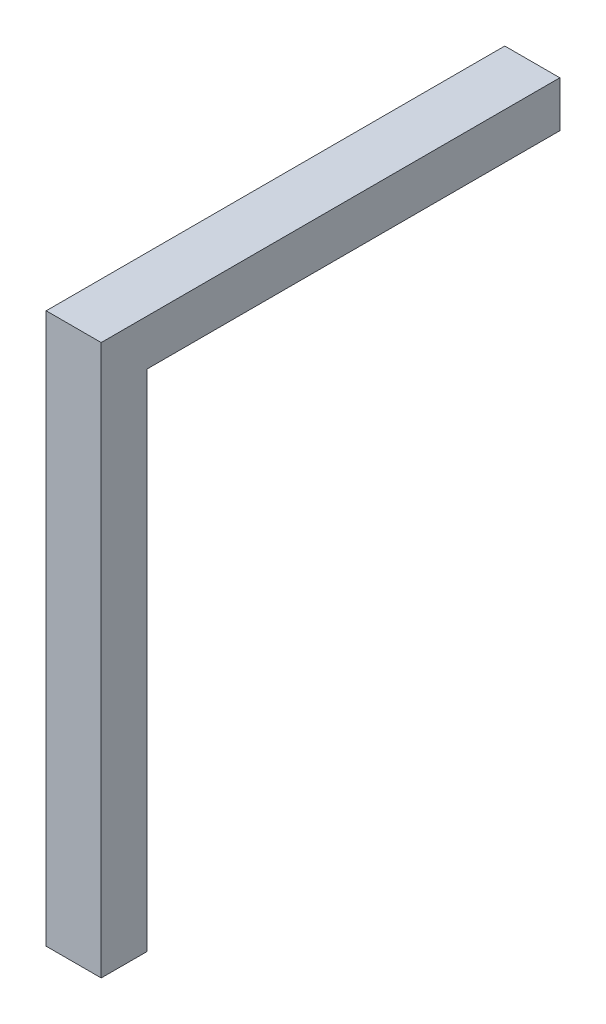
ISO-10303-21;
HEADER;
FILE_DESCRIPTION(('STEP AP214'),'2;1');
FILE_NAME('part.step','',(''),(''),'','','');
FILE_SCHEMA(('AUTOMOTIVE_DESIGN { 1 0 10303 214 1 1 1 1 }'));
ENDSEC;
DATA;
#1=APPLICATION_CONTEXT('core data for automotive mechanical design processes');
#2=APPLICATION_PROTOCOL_DEFINITION('international standard','automotive_design',2000,#1);
#3=PRODUCT_CONTEXT('',#1,'mechanical');
#4=PRODUCT('Part','Part','',(#3));
#5=PRODUCT_RELATED_PRODUCT_CATEGORY('part','',(#4));
#6=PRODUCT_DEFINITION_FORMATION('','',#4);
#7=PRODUCT_DEFINITION_CONTEXT('part definition',#1,'design');
#8=PRODUCT_DEFINITION('design','',#6,#7);
#9=PRODUCT_DEFINITION_SHAPE('','',#8);
#10=(LENGTH_UNIT() NAMED_UNIT(*) SI_UNIT(.MILLI.,.METRE.));
#11=(NAMED_UNIT(*) PLANE_ANGLE_UNIT() SI_UNIT($,.RADIAN.));
#12=(NAMED_UNIT(*) SI_UNIT($,.STERADIAN.) SOLID_ANGLE_UNIT());
#13=UNCERTAINTY_MEASURE_WITH_UNIT(LENGTH_MEASURE(1.E-05),#10,'distance_accuracy_value','');
#14=(GEOMETRIC_REPRESENTATION_CONTEXT(3) GLOBAL_UNCERTAINTY_ASSIGNED_CONTEXT((#13)) GLOBAL_UNIT_ASSIGNED_CONTEXT((#10,
#11,#12)) REPRESENTATION_CONTEXT('',''));
#15=CARTESIAN_POINT('',(0.,0.,0.));
#16=DIRECTION('',(0.,0.,1.));
#17=DIRECTION('',(1.,0.,0.));
#18=AXIS2_PLACEMENT_3D('',#15,#16,#17);
#19=CARTESIAN_POINT('',(6.,31.4321608040201,10.));
#20=DIRECTION('',(0.,0.,1.));
#21=DIRECTION('',(1.,0.,0.));
#22=AXIS2_PLACEMENT_3D('',#19,#20,#21);
#23=PLANE('',#22);
#24=DIRECTION('',(0.,1.,0.));
#25=VECTOR('',#24,1.);
#26=CARTESIAN_POINT('',(0.,31.4321608040201,10.));
#27=LINE('',#26,#25);
#28=CARTESIAN_POINT('',(0.,31.4321608040201,10.));
#29=VERTEX_POINT('',#28);
#30=CARTESIAN_POINT('',(0.,36.4321608040201,10.));
#31=VERTEX_POINT('',#30);
#32=EDGE_CURVE('E128',#29,#31,#27,.T.);
#33=ORIENTED_EDGE('',*,*,#32,.T.);
#34=DIRECTION('',(-1.,0.,0.));
#35=VECTOR('',#34,1.);
#36=CARTESIAN_POINT('',(6.,36.4321608040201,10.));
#37=LINE('',#36,#35);
#38=CARTESIAN_POINT('',(6.,36.4321608040201,10.));
#39=VERTEX_POINT('',#38);
#40=EDGE_CURVE('E11',#39,#31,#37,.T.);
#41=ORIENTED_EDGE('',*,*,#40,.F.);
#42=DIRECTION('',(0.,1.,0.));
#43=VECTOR('',#42,1.);
#44=CARTESIAN_POINT('',(6.,31.4321608040201,10.));
#45=LINE('',#44,#43);
#46=CARTESIAN_POINT('',(6.,31.4321608040201,10.));
#47=VERTEX_POINT('',#46);
#48=EDGE_CURVE('E144',#47,#39,#45,.T.);
#49=ORIENTED_EDGE('',*,*,#48,.F.);
#50=DIRECTION('',(-1.,0.,0.));
#51=VECTOR('',#50,1.);
#52=CARTESIAN_POINT('',(6.,31.4321608040201,10.));
#53=LINE('',#52,#51);
#54=EDGE_CURVE('E124',#47,#29,#53,.T.);
#55=ORIENTED_EDGE('',*,*,#54,.T.);
#56=EDGE_LOOP('',(#33,#41,#49,#55));
#57=FACE_BOUND('',#56,.T.);
#58=ADVANCED_FACE('F39',(#57),#23,.F.);
#59=CARTESIAN_POINT('',(6.,36.4321608040201,10.));
#60=DIRECTION('',(0.,-1.,0.));
#61=DIRECTION('',(0.,0.,-1.));
#62=AXIS2_PLACEMENT_3D('',#59,#60,#61);
#63=PLANE('',#62);
#64=DIRECTION('',(0.,0.,1.));
#65=VECTOR('',#64,1.);
#66=CARTESIAN_POINT('',(0.,36.4321608040201,10.));
#67=LINE('',#66,#65);
#68=CARTESIAN_POINT('',(0.,36.4321608040201,60.));
#69=VERTEX_POINT('',#68);
#70=EDGE_CURVE('E132',#31,#69,#67,.T.);
#71=ORIENTED_EDGE('',*,*,#70,.T.);
#72=DIRECTION('',(-1.,0.,0.));
#73=VECTOR('',#72,1.);
#74=CARTESIAN_POINT('',(6.,36.4321608040201,60.));
#75=LINE('',#74,#73);
#76=CARTESIAN_POINT('',(6.,36.4321608040201,60.));
#77=VERTEX_POINT('',#76);
#78=EDGE_CURVE('E48',#77,#69,#75,.T.);
#79=ORIENTED_EDGE('',*,*,#78,.F.);
#80=DIRECTION('',(0.,0.,1.));
#81=VECTOR('',#80,1.);
#82=CARTESIAN_POINT('',(6.,36.4321608040201,10.));
#83=LINE('',#82,#81);
#84=EDGE_CURVE('E93',#39,#77,#83,.T.);
#85=ORIENTED_EDGE('',*,*,#84,.F.);
#86=ORIENTED_EDGE('',*,*,#40,.T.);
#87=EDGE_LOOP('',(#71,#79,#85,#86));
#88=FACE_BOUND('',#87,.T.);
#89=ADVANCED_FACE('F172',(#88),#63,.F.);
#90=CARTESIAN_POINT('',(6.,36.4321608040201,60.));
#91=DIRECTION('',(0.,0.,-1.));
#92=DIRECTION('',(0.,1.,0.));
#93=AXIS2_PLACEMENT_3D('',#90,#91,#92);
#94=PLANE('',#93);
#95=DIRECTION('',(0.,-1.,0.));
#96=VECTOR('',#95,1.);
#97=CARTESIAN_POINT('',(0.,36.4321608040201,60.));
#98=LINE('',#97,#96);
#99=CARTESIAN_POINT('',(0.,-23.5678391959799,60.));
#100=VERTEX_POINT('',#99);
#101=EDGE_CURVE('E135',#69,#100,#98,.T.);
#102=ORIENTED_EDGE('',*,*,#101,.T.);
#103=DIRECTION('',(-1.,0.,0.));
#104=VECTOR('',#103,1.);
#105=CARTESIAN_POINT('',(6.,-23.5678391959799,60.));
#106=LINE('',#105,#104);
#107=CARTESIAN_POINT('',(6.,-23.5678391959799,60.));
#108=VERTEX_POINT('',#107);
#109=EDGE_CURVE('E117',#108,#100,#106,.T.);
#110=ORIENTED_EDGE('',*,*,#109,.F.);
#111=DIRECTION('',(0.,-1.,0.));
#112=VECTOR('',#111,1.);
#113=CARTESIAN_POINT('',(6.,36.4321608040201,60.));
#114=LINE('',#113,#112);
#115=EDGE_CURVE('E106',#77,#108,#114,.T.);
#116=ORIENTED_EDGE('',*,*,#115,.F.);
#117=ORIENTED_EDGE('',*,*,#78,.T.);
#118=EDGE_LOOP('',(#102,#110,#116,#117));
#119=FACE_BOUND('',#118,.T.);
#120=ADVANCED_FACE('F154',(#119),#94,.F.);
#121=CARTESIAN_POINT('',(6.,-23.5678391959799,60.));
#122=DIRECTION('',(0.,1.,0.));
#123=DIRECTION('',(0.,0.,1.));
#124=AXIS2_PLACEMENT_3D('',#121,#122,#123);
#125=PLANE('',#124);
#126=DIRECTION('',(0.,0.,-1.));
#127=VECTOR('',#126,1.);
#128=CARTESIAN_POINT('',(0.,-23.5678391959799,60.));
#129=LINE('',#128,#127);
#130=CARTESIAN_POINT('',(0.,-23.5678391959799,55.));
#131=VERTEX_POINT('',#130);
#132=EDGE_CURVE('E115',#100,#131,#129,.T.);
#133=ORIENTED_EDGE('',*,*,#132,.T.);
#134=DIRECTION('',(-1.,0.,0.));
#135=VECTOR('',#134,1.);
#136=CARTESIAN_POINT('',(6.,-23.5678391959799,55.));
#137=LINE('',#136,#135);
#138=CARTESIAN_POINT('',(6.,-23.5678391959799,55.));
#139=VERTEX_POINT('',#138);
#140=EDGE_CURVE('E112',#139,#131,#137,.T.);
#141=ORIENTED_EDGE('',*,*,#140,.F.);
#142=DIRECTION('',(0.,0.,-1.));
#143=VECTOR('',#142,1.);
#144=CARTESIAN_POINT('',(6.,-23.5678391959799,60.));
#145=LINE('',#144,#143);
#146=EDGE_CURVE('E100',#108,#139,#145,.T.);
#147=ORIENTED_EDGE('',*,*,#146,.F.);
#148=ORIENTED_EDGE('',*,*,#109,.T.);
#149=EDGE_LOOP('',(#133,#141,#147,#148));
#150=FACE_BOUND('',#149,.T.);
#151=ADVANCED_FACE('F113',(#150),#125,.F.);
#152=CARTESIAN_POINT('',(6.,-23.5678391959799,55.));
#153=DIRECTION('',(0.,0.,1.));
#154=DIRECTION('',(1.,0.,0.));
#155=AXIS2_PLACEMENT_3D('',#152,#153,#154);
#156=PLANE('',#155);
#157=DIRECTION('',(0.,1.,0.));
#158=VECTOR('',#157,1.);
#159=CARTESIAN_POINT('',(0.,-23.5678391959799,55.));
#160=LINE('',#159,#158);
#161=CARTESIAN_POINT('',(0.,31.4321608040201,55.));
#162=VERTEX_POINT('',#161);
#163=EDGE_CURVE('E79',#131,#162,#160,.T.);
#164=ORIENTED_EDGE('',*,*,#163,.T.);
#165=DIRECTION('',(-1.,0.,0.));
#166=VECTOR('',#165,1.);
#167=CARTESIAN_POINT('',(6.,31.4321608040201,55.));
#168=LINE('',#167,#166);
#169=CARTESIAN_POINT('',(6.,31.4321608040201,55.));
#170=VERTEX_POINT('',#169);
#171=EDGE_CURVE('E118',#170,#162,#168,.T.);
#172=ORIENTED_EDGE('',*,*,#171,.F.);
#173=DIRECTION('',(0.,1.,0.));
#174=VECTOR('',#173,1.);
#175=CARTESIAN_POINT('',(6.,-23.5678391959799,55.));
#176=LINE('',#175,#174);
#177=EDGE_CURVE('E104',#139,#170,#176,.T.);
#178=ORIENTED_EDGE('',*,*,#177,.F.);
#179=ORIENTED_EDGE('',*,*,#140,.T.);
#180=EDGE_LOOP('',(#164,#172,#178,#179));
#181=FACE_BOUND('',#180,.T.);
#182=ADVANCED_FACE('F120',(#181),#156,.F.);
#183=CARTESIAN_POINT('',(6.,31.4321608040201,55.));
#184=DIRECTION('',(0.,1.,0.));
#185=DIRECTION('',(0.,0.,1.));
#186=AXIS2_PLACEMENT_3D('',#183,#184,#185);
#187=PLANE('',#186);
#188=DIRECTION('',(0.,0.,-1.));
#189=VECTOR('',#188,1.);
#190=CARTESIAN_POINT('',(0.,31.4321608040201,55.));
#191=LINE('',#190,#189);
#192=EDGE_CURVE('E85',#162,#29,#191,.T.);
#193=ORIENTED_EDGE('',*,*,#192,.T.);
#194=ORIENTED_EDGE('',*,*,#54,.F.);
#195=DIRECTION('',(0.,0.,-1.));
#196=VECTOR('',#195,1.);
#197=CARTESIAN_POINT('',(6.,31.4321608040201,55.));
#198=LINE('',#197,#196);
#199=EDGE_CURVE('E56',#170,#47,#198,.T.);
#200=ORIENTED_EDGE('',*,*,#199,.F.);
#201=ORIENTED_EDGE('',*,*,#171,.T.);
#202=EDGE_LOOP('',(#193,#194,#200,#201));
#203=FACE_BOUND('',#202,.T.);
#204=ADVANCED_FACE('F161',(#203),#187,.F.);
#205=CARTESIAN_POINT('',(6.,0.,0.));
#206=DIRECTION('',(1.,0.,0.));
#207=DIRECTION('',(0.,0.,-1.));
#208=AXIS2_PLACEMENT_3D('',#205,#206,#207);
#209=PLANE('',#208);
#210=ORIENTED_EDGE('',*,*,#48,.T.);
#211=ORIENTED_EDGE('',*,*,#84,.T.);
#212=ORIENTED_EDGE('',*,*,#115,.T.);
#213=ORIENTED_EDGE('',*,*,#146,.T.);
#214=ORIENTED_EDGE('',*,*,#177,.T.);
#215=ORIENTED_EDGE('',*,*,#199,.T.);
#216=EDGE_LOOP('',(#210,#211,#212,#213,#214,#215));
#217=FACE_BOUND('',#216,.T.);
#218=ADVANCED_FACE('F102',(#217),#209,.T.);
#219=CARTESIAN_POINT('',(0.,0.,0.));
#220=DIRECTION('',(1.,0.,0.));
#221=DIRECTION('',(0.,0.,-1.));
#222=AXIS2_PLACEMENT_3D('',#219,#220,#221);
#223=PLANE('',#222);
#224=ORIENTED_EDGE('',*,*,#32,.F.);
#225=ORIENTED_EDGE('',*,*,#192,.F.);
#226=ORIENTED_EDGE('',*,*,#163,.F.);
#227=ORIENTED_EDGE('',*,*,#132,.F.);
#228=ORIENTED_EDGE('',*,*,#101,.F.);
#229=ORIENTED_EDGE('',*,*,#70,.F.);
#230=EDGE_LOOP('',(#224,#225,#226,#227,#228,#229));
#231=FACE_BOUND('',#230,.T.);
#232=ADVANCED_FACE('F157',(#231),#223,.F.);
#233=CLOSED_SHELL('',(#58,#89,#120,#151,#182,#204,#218,#232));
#234=MANIFOLD_SOLID_BREP('B2',#233);
#235=ADVANCED_BREP_SHAPE_REPRESENTATION('',(#18,#234),#14);
#236=SHAPE_DEFINITION_REPRESENTATION(#9,#235);
ENDSEC;
END-ISO-10303-21;
